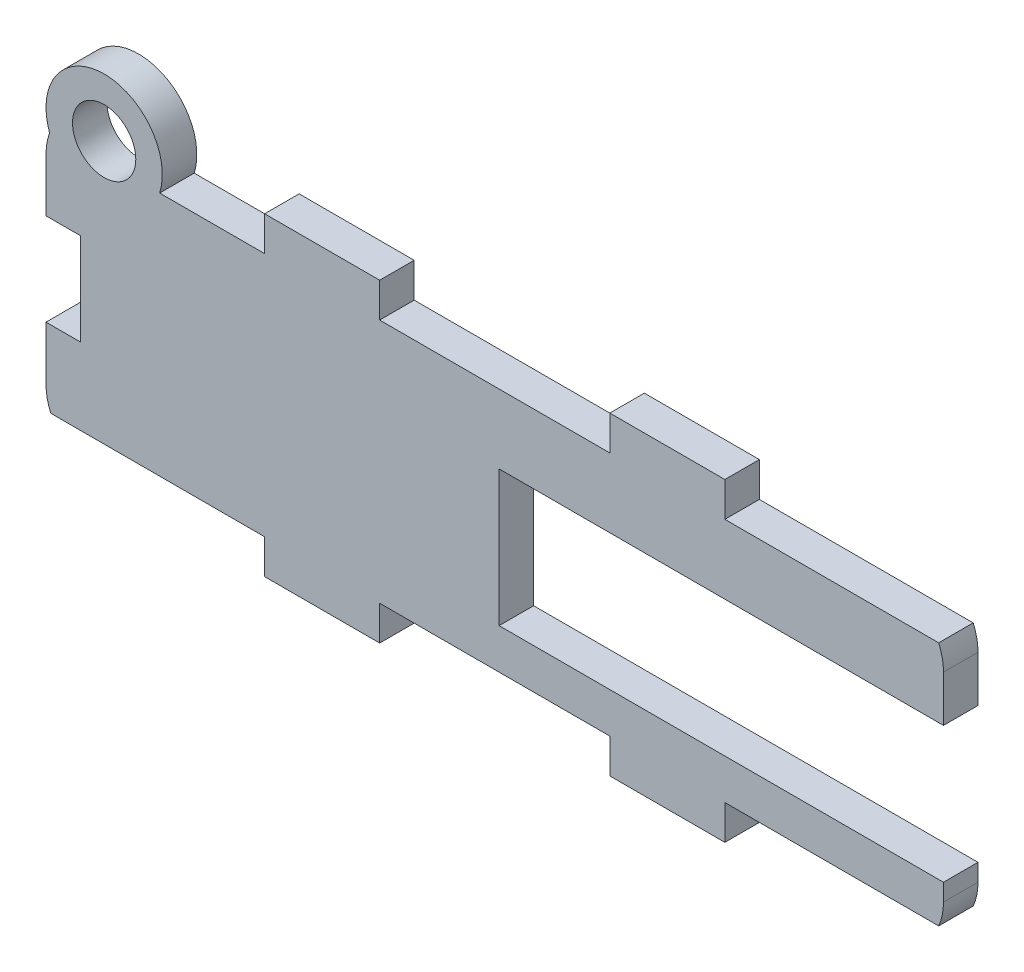
ISO-10303-21;
HEADER;
FILE_DESCRIPTION(('STEP AP214'),'2;1');
FILE_NAME('part.step','',(''),(''),'','','');
FILE_SCHEMA(('AUTOMOTIVE_DESIGN { 1 0 10303 214 1 1 1 1 }'));
ENDSEC;
DATA;
#1=APPLICATION_CONTEXT('core data for automotive mechanical design processes');
#2=APPLICATION_PROTOCOL_DEFINITION('international standard','automotive_design',2000,#1);
#3=PRODUCT_CONTEXT('',#1,'mechanical');
#4=PRODUCT('Part','Part','',(#3));
#5=PRODUCT_RELATED_PRODUCT_CATEGORY('part','',(#4));
#6=PRODUCT_DEFINITION_FORMATION('','',#4);
#7=PRODUCT_DEFINITION_CONTEXT('part definition',#1,'design');
#8=PRODUCT_DEFINITION('design','',#6,#7);
#9=PRODUCT_DEFINITION_SHAPE('','',#8);
#10=(LENGTH_UNIT() NAMED_UNIT(*) SI_UNIT(.MILLI.,.METRE.));
#11=(NAMED_UNIT(*) PLANE_ANGLE_UNIT() SI_UNIT($,.RADIAN.));
#12=(NAMED_UNIT(*) SI_UNIT($,.STERADIAN.) SOLID_ANGLE_UNIT());
#13=UNCERTAINTY_MEASURE_WITH_UNIT(LENGTH_MEASURE(1.E-05),#10,'distance_accuracy_value','');
#14=(GEOMETRIC_REPRESENTATION_CONTEXT(3) GLOBAL_UNCERTAINTY_ASSIGNED_CONTEXT((#13)) GLOBAL_UNIT_ASSIGNED_CONTEXT((#10,
#11,#12)) REPRESENTATION_CONTEXT('',''));
#15=CARTESIAN_POINT('',(0.,0.,0.));
#16=DIRECTION('',(0.,0.,1.));
#17=DIRECTION('',(1.,0.,0.));
#18=AXIS2_PLACEMENT_3D('',#15,#16,#17);
#19=CARTESIAN_POINT('',(-26.,2.00000000000004,3.));
#20=DIRECTION('',(1.,0.,0.));
#21=DIRECTION('',(0.,0.,-1.));
#22=AXIS2_PLACEMENT_3D('',#19,#20,#21);
#23=PLANE('',#22);
#24=DIRECTION('',(0.,0.,1.));
#25=VECTOR('',#24,1.);
#26=CARTESIAN_POINT('',(-26.,6.65592079454651,0.));
#27=LINE('',#26,#25);
#28=CARTESIAN_POINT('',(-26.,6.65592079454651,0.));
#29=VERTEX_POINT('',#28);
#30=CARTESIAN_POINT('',(-26.,6.65592079454651,3.));
#31=VERTEX_POINT('',#30);
#32=EDGE_CURVE('E252',#29,#31,#27,.T.);
#33=ORIENTED_EDGE('',*,*,#32,.F.);
#34=DIRECTION('',(0.,-1.,0.));
#35=VECTOR('',#34,1.);
#36=CARTESIAN_POINT('',(-26.,2.00000000000004,0.));
#37=LINE('',#36,#35);
#38=CARTESIAN_POINT('',(-26.,2.,0.));
#39=VERTEX_POINT('',#38);
#40=EDGE_CURVE('E264',#29,#39,#37,.T.);
#41=ORIENTED_EDGE('',*,*,#40,.T.);
#42=DIRECTION('',(0.,0.,-1.));
#43=VECTOR('',#42,1.);
#44=CARTESIAN_POINT('',(-26.,2.,3.));
#45=LINE('',#44,#43);
#46=CARTESIAN_POINT('',(-26.,2.,3.));
#47=VERTEX_POINT('',#46);
#48=EDGE_CURVE('E360',#47,#39,#45,.T.);
#49=ORIENTED_EDGE('',*,*,#48,.F.);
#50=DIRECTION('',(0.,-1.,0.));
#51=VECTOR('',#50,1.);
#52=CARTESIAN_POINT('',(-26.,2.00000000000004,3.));
#53=LINE('',#52,#51);
#54=EDGE_CURVE('E266',#31,#47,#53,.T.);
#55=ORIENTED_EDGE('',*,*,#54,.F.);
#56=EDGE_LOOP('',(#33,#41,#49,#55));
#57=FACE_BOUND('',#56,.T.);
#58=ADVANCED_FACE('F33',(#57),#23,.F.);
#59=CARTESIAN_POINT('',(47.,19.311841589093,3.));
#60=DIRECTION('',(0.,0.,-1.));
#61=DIRECTION('',(-1.,0.,0.));
#62=AXIS2_PLACEMENT_3D('',#59,#60,#61);
#63=PLANE('',#62);
#64=CARTESIAN_POINT('',(-20.9460971389768,22.811841589093,3.));
#65=DIRECTION('',(0.,0.,1.));
#66=DIRECTION('',(1.,0.,0.));
#67=AXIS2_PLACEMENT_3D('',#64,#65,#66);
#68=CIRCLE('',#67,2.74976983341872);
#69=CARTESIAN_POINT('',(-18.1963273055581,22.811841589093,3.));
#70=VERTEX_POINT('',#69);
#71=EDGE_CURVE('E267',#70,#70,#68,.T.);
#72=ORIENTED_EDGE('',*,*,#71,.F.);
#73=EDGE_LOOP('',(#72));
#74=FACE_BOUND('',#73,.T.);
#75=DIRECTION('',(-1.,0.,0.));
#76=VECTOR('',#75,1.);
#77=CARTESIAN_POINT('',(-23.0000000000001,6.65592079454651,3.));
#78=LINE('',#77,#76);
#79=CARTESIAN_POINT('',(-23.0000000000001,6.65592079454651,3.));
#80=VERTEX_POINT('',#79);
#81=EDGE_CURVE('E592',#80,#31,#78,.T.);
#82=ORIENTED_EDGE('',*,*,#81,.T.);
#83=ORIENTED_EDGE('',*,*,#54,.T.);
#84=CARTESIAN_POINT('',(-21.,2.,3.));
#85=DIRECTION('',(0.,0.,1.));
#86=DIRECTION('',(-1.,0.,0.));
#87=AXIS2_PLACEMENT_3D('',#84,#85,#86);
#88=CIRCLE('',#87,5.);
#89=CARTESIAN_POINT('',(-25.5825756949558,0.,3.));
#90=VERTEX_POINT('',#89);
#91=EDGE_CURVE('E468',#47,#90,#88,.T.);
#92=ORIENTED_EDGE('',*,*,#91,.T.);
#93=DIRECTION('',(1.,0.,0.));
#94=VECTOR('',#93,1.);
#95=CARTESIAN_POINT('',(-6.99999999999999,0.,3.));
#96=LINE('',#95,#94);
#97=CARTESIAN_POINT('',(-6.99999999999999,0.,3.));
#98=VERTEX_POINT('',#97);
#99=EDGE_CURVE('E470',#90,#98,#96,.T.);
#100=ORIENTED_EDGE('',*,*,#99,.T.);
#101=DIRECTION('',(0.,-1.,0.));
#102=VECTOR('',#101,1.);
#103=CARTESIAN_POINT('',(-6.99999999999999,0.,3.));
#104=LINE('',#103,#102);
#105=CARTESIAN_POINT('',(-6.99999999999999,-3.,3.));
#106=VERTEX_POINT('',#105);
#107=EDGE_CURVE('E472',#98,#106,#104,.T.);
#108=ORIENTED_EDGE('',*,*,#107,.T.);
#109=DIRECTION('',(1.,0.,0.));
#110=VECTOR('',#109,1.);
#111=CARTESIAN_POINT('',(-6.99999999999999,-3.,3.));
#112=LINE('',#111,#110);
#113=CARTESIAN_POINT('',(3.00000000000001,-3.,3.));
#114=VERTEX_POINT('',#113);
#115=EDGE_CURVE('E474',#106,#114,#112,.T.);
#116=ORIENTED_EDGE('',*,*,#115,.T.);
#117=DIRECTION('',(0.,1.,0.));
#118=VECTOR('',#117,1.);
#119=CARTESIAN_POINT('',(3.00000000000001,-3.,3.));
#120=LINE('',#119,#118);
#121=CARTESIAN_POINT('',(3.00000000000001,0.,3.));
#122=VERTEX_POINT('',#121);
#123=EDGE_CURVE('E476',#114,#122,#120,.T.);
#124=ORIENTED_EDGE('',*,*,#123,.T.);
#125=DIRECTION('',(1.,0.,0.));
#126=VECTOR('',#125,1.);
#127=CARTESIAN_POINT('',(3.00000000000001,0.,3.));
#128=LINE('',#127,#126);
#129=CARTESIAN_POINT('',(23.,0.,3.));
#130=VERTEX_POINT('',#129);
#131=EDGE_CURVE('E478',#122,#130,#128,.T.);
#132=ORIENTED_EDGE('',*,*,#131,.T.);
#133=DIRECTION('',(0.,-1.,0.));
#134=VECTOR('',#133,1.);
#135=CARTESIAN_POINT('',(23.,-3.,3.));
#136=LINE('',#135,#134);
#137=CARTESIAN_POINT('',(23.,-3.,3.));
#138=VERTEX_POINT('',#137);
#139=EDGE_CURVE('E480',#130,#138,#136,.T.);
#140=ORIENTED_EDGE('',*,*,#139,.T.);
#141=DIRECTION('',(1.,0.,0.));
#142=VECTOR('',#141,1.);
#143=CARTESIAN_POINT('',(23.,-3.,3.));
#144=LINE('',#143,#142);
#145=CARTESIAN_POINT('',(33.,-3.,3.));
#146=VERTEX_POINT('',#145);
#147=EDGE_CURVE('E482',#138,#146,#144,.T.);
#148=ORIENTED_EDGE('',*,*,#147,.T.);
#149=DIRECTION('',(0.,1.,0.));
#150=VECTOR('',#149,1.);
#151=CARTESIAN_POINT('',(33.,-3.,3.));
#152=LINE('',#151,#150);
#153=CARTESIAN_POINT('',(33.,0.,3.));
#154=VERTEX_POINT('',#153);
#155=EDGE_CURVE('E484',#146,#154,#152,.T.);
#156=ORIENTED_EDGE('',*,*,#155,.T.);
#157=DIRECTION('',(1.,0.,0.));
#158=VECTOR('',#157,1.);
#159=CARTESIAN_POINT('',(33.,0.,3.));
#160=LINE('',#159,#158);
#161=CARTESIAN_POINT('',(51.5825756949558,0.,3.));
#162=VERTEX_POINT('',#161);
#163=EDGE_CURVE('E486',#154,#162,#160,.T.);
#164=ORIENTED_EDGE('',*,*,#163,.T.);
#165=CARTESIAN_POINT('',(47.,2.,3.));
#166=DIRECTION('',(0.,0.,1.));
#167=DIRECTION('',(1.,0.,0.));
#168=AXIS2_PLACEMENT_3D('',#165,#166,#167);
#169=CIRCLE('',#168,5.);
#170=CARTESIAN_POINT('',(52.,2.00000000000004,3.));
#171=VERTEX_POINT('',#170);
#172=EDGE_CURVE('E488',#162,#171,#169,.T.);
#173=ORIENTED_EDGE('',*,*,#172,.T.);
#174=DIRECTION('',(0.,1.,0.));
#175=VECTOR('',#174,1.);
#176=CARTESIAN_POINT('',(52.,2.00000000000004,3.));
#177=LINE('',#176,#175);
#178=CARTESIAN_POINT('',(52.,3.5,3.));
#179=VERTEX_POINT('',#178);
#180=EDGE_CURVE('E491',#171,#179,#177,.T.);
#181=ORIENTED_EDGE('',*,*,#180,.T.);
#182=DIRECTION('',(1.,0.,0.));
#183=VECTOR('',#182,1.);
#184=CARTESIAN_POINT('',(13.38,3.49999999999997,3.));
#185=LINE('',#184,#183);
#186=CARTESIAN_POINT('',(13.38,3.49999999999997,3.));
#187=VERTEX_POINT('',#186);
#188=EDGE_CURVE('E433',#187,#179,#185,.T.);
#189=ORIENTED_EDGE('',*,*,#188,.F.);
#190=DIRECTION('',(0.,-1.,0.));
#191=VECTOR('',#190,1.);
#192=CARTESIAN_POINT('',(13.38,3.49999999999997,3.));
#193=LINE('',#192,#191);
#194=CARTESIAN_POINT('',(13.38,15.3,3.));
#195=VERTEX_POINT('',#194);
#196=EDGE_CURVE('E438',#195,#187,#193,.T.);
#197=ORIENTED_EDGE('',*,*,#196,.F.);
#198=DIRECTION('',(-1.,0.,0.));
#199=VECTOR('',#198,1.);
#200=CARTESIAN_POINT('',(13.38,15.3,3.));
#201=LINE('',#200,#199);
#202=CARTESIAN_POINT('',(52.,15.3,3.));
#203=VERTEX_POINT('',#202);
#204=EDGE_CURVE('E435',#203,#195,#201,.T.);
#205=ORIENTED_EDGE('',*,*,#204,.F.);
#206=CARTESIAN_POINT('',(52.,19.311841589093,3.));
#207=VERTEX_POINT('',#206);
#208=EDGE_CURVE('E490',#203,#207,#177,.T.);
#209=ORIENTED_EDGE('',*,*,#208,.T.);
#210=CARTESIAN_POINT('',(47.,19.311841589093,3.));
#211=DIRECTION('',(0.,0.,1.));
#212=DIRECTION('',(-1.,0.,0.));
#213=AXIS2_PLACEMENT_3D('',#210,#211,#212);
#214=CIRCLE('',#213,5.);
#215=CARTESIAN_POINT('',(51.5825756949558,21.311841589093,3.));
#216=VERTEX_POINT('',#215);
#217=EDGE_CURVE('E494',#207,#216,#214,.T.);
#218=ORIENTED_EDGE('',*,*,#217,.T.);
#219=DIRECTION('',(-1.,0.,0.));
#220=VECTOR('',#219,1.);
#221=CARTESIAN_POINT('',(33.,21.311841589093,3.));
#222=LINE('',#221,#220);
#223=CARTESIAN_POINT('',(33.,21.311841589093,3.));
#224=VERTEX_POINT('',#223);
#225=EDGE_CURVE('E496',#216,#224,#222,.T.);
#226=ORIENTED_EDGE('',*,*,#225,.T.);
#227=DIRECTION('',(0.,1.,0.));
#228=VECTOR('',#227,1.);
#229=CARTESIAN_POINT('',(33.,24.311841589093,3.));
#230=LINE('',#229,#228);
#231=CARTESIAN_POINT('',(33.,24.311841589093,3.));
#232=VERTEX_POINT('',#231);
#233=EDGE_CURVE('E318',#224,#232,#230,.T.);
#234=ORIENTED_EDGE('',*,*,#233,.T.);
#235=DIRECTION('',(-1.,0.,0.));
#236=VECTOR('',#235,1.);
#237=CARTESIAN_POINT('',(23.,24.311841589093,3.));
#238=LINE('',#237,#236);
#239=CARTESIAN_POINT('',(23.,24.311841589093,3.));
#240=VERTEX_POINT('',#239);
#241=EDGE_CURVE('E313',#232,#240,#238,.T.);
#242=ORIENTED_EDGE('',*,*,#241,.T.);
#243=DIRECTION('',(0.,-1.,0.));
#244=VECTOR('',#243,1.);
#245=CARTESIAN_POINT('',(23.,24.311841589093,3.));
#246=LINE('',#245,#244);
#247=CARTESIAN_POINT('',(23.,21.311841589093,3.));
#248=VERTEX_POINT('',#247);
#249=EDGE_CURVE('E452',#240,#248,#246,.T.);
#250=ORIENTED_EDGE('',*,*,#249,.T.);
#251=DIRECTION('',(-1.,0.,0.));
#252=VECTOR('',#251,1.);
#253=CARTESIAN_POINT('',(3.00000000000001,21.311841589093,3.));
#254=LINE('',#253,#252);
#255=CARTESIAN_POINT('',(3.00000000000001,21.311841589093,3.));
#256=VERTEX_POINT('',#255);
#257=EDGE_CURVE('E384',#248,#256,#254,.T.);
#258=ORIENTED_EDGE('',*,*,#257,.T.);
#259=DIRECTION('',(0.,1.,0.));
#260=VECTOR('',#259,1.);
#261=CARTESIAN_POINT('',(3.00000000000001,24.311841589093,3.));
#262=LINE('',#261,#260);
#263=CARTESIAN_POINT('',(3.00000000000001,24.311841589093,3.));
#264=VERTEX_POINT('',#263);
#265=EDGE_CURVE('E455',#256,#264,#262,.T.);
#266=ORIENTED_EDGE('',*,*,#265,.T.);
#267=DIRECTION('',(-1.,0.,0.));
#268=VECTOR('',#267,1.);
#269=CARTESIAN_POINT('',(-6.99999999999999,24.311841589093,3.));
#270=LINE('',#269,#268);
#271=CARTESIAN_POINT('',(-6.99999999999999,24.311841589093,3.));
#272=VERTEX_POINT('',#271);
#273=EDGE_CURVE('E457',#264,#272,#270,.T.);
#274=ORIENTED_EDGE('',*,*,#273,.T.);
#275=DIRECTION('',(0.,-1.,0.));
#276=VECTOR('',#275,1.);
#277=CARTESIAN_POINT('',(-6.99999999999999,21.311841589093,3.));
#278=LINE('',#277,#276);
#279=CARTESIAN_POINT('',(-6.99999999999999,21.311841589093,3.));
#280=VERTEX_POINT('',#279);
#281=EDGE_CURVE('E459',#272,#280,#278,.T.);
#282=ORIENTED_EDGE('',*,*,#281,.T.);
#283=DIRECTION('',(-1.,0.,0.));
#284=VECTOR('',#283,1.);
#285=CARTESIAN_POINT('',(-6.99999999999999,21.311841589093,3.));
#286=LINE('',#285,#284);
#287=CARTESIAN_POINT('',(-16.1199253508347,21.311841589093,3.));
#288=VERTEX_POINT('',#287);
#289=EDGE_CURVE('E461',#280,#288,#286,.T.);
#290=ORIENTED_EDGE('',*,*,#289,.T.);
#291=CARTESIAN_POINT('',(-20.9460971389768,22.811841589093,3.));
#292=DIRECTION('',(0.,0.,1.));
#293=DIRECTION('',(1.,0.,0.));
#294=AXIS2_PLACEMENT_3D('',#291,#292,#293);
#295=CIRCLE('',#294,5.05390286102321);
#296=CARTESIAN_POINT('',(-25.6855550398169,21.0569988796678,3.));
#297=VERTEX_POINT('',#296);
#298=EDGE_CURVE('E56',#288,#297,#295,.T.);
#299=ORIENTED_EDGE('',*,*,#298,.T.);
#300=CARTESIAN_POINT('',(-21.,19.311841589093,3.));
#301=DIRECTION('',(0.,0.,1.));
#302=DIRECTION('',(-1.,0.,0.));
#303=AXIS2_PLACEMENT_3D('',#300,#301,#302);
#304=CIRCLE('',#303,5.);
#305=CARTESIAN_POINT('',(-26.,19.311841589093,3.));
#306=VERTEX_POINT('',#305);
#307=EDGE_CURVE('E463',#297,#306,#304,.T.);
#308=ORIENTED_EDGE('',*,*,#307,.T.);
#309=CARTESIAN_POINT('',(-26.,14.6559207945465,3.));
#310=VERTEX_POINT('',#309);
#311=EDGE_CURVE('E465',#306,#310,#53,.T.);
#312=ORIENTED_EDGE('',*,*,#311,.T.);
#313=DIRECTION('',(-1.,0.,0.));
#314=VECTOR('',#313,1.);
#315=CARTESIAN_POINT('',(-23.0000000000001,14.6559207945465,3.));
#316=LINE('',#315,#314);
#317=CARTESIAN_POINT('',(-23.0000000000001,14.6559207945465,3.));
#318=VERTEX_POINT('',#317);
#319=EDGE_CURVE('E595',#318,#310,#316,.T.);
#320=ORIENTED_EDGE('',*,*,#319,.F.);
#321=DIRECTION('',(0.,1.,0.));
#322=VECTOR('',#321,1.);
#323=CARTESIAN_POINT('',(-23.0000000000001,6.65592079454651,3.));
#324=LINE('',#323,#322);
#325=EDGE_CURVE('E259',#80,#318,#324,.T.);
#326=ORIENTED_EDGE('',*,*,#325,.F.);
#327=EDGE_LOOP('',(#82,#83,#92,#100,#108,#116,#124,#132,#140,#148,#156,#164,#173,#181,#189,#197,
#205,#209,#218,#226,#234,#242,#250,#258,#266,#274,#282,#290,#299,#308,#312,#320,#326));
#328=FACE_BOUND('',#327,.T.);
#329=ADVANCED_FACE('F527',(#74,#328),#63,.F.);
#330=CARTESIAN_POINT('',(47.,19.311841589093,0.));
#331=DIRECTION('',(0.,0.,-1.));
#332=DIRECTION('',(-1.,0.,0.));
#333=AXIS2_PLACEMENT_3D('',#330,#331,#332);
#334=PLANE('',#333);
#335=CARTESIAN_POINT('',(-20.9460971389768,22.811841589093,0.));
#336=DIRECTION('',(0.,0.,1.));
#337=DIRECTION('',(1.,0.,0.));
#338=AXIS2_PLACEMENT_3D('',#335,#336,#337);
#339=CIRCLE('',#338,2.74976983341872);
#340=CARTESIAN_POINT('',(-18.1963273055581,22.811841589093,0.));
#341=VERTEX_POINT('',#340);
#342=EDGE_CURVE('E420',#341,#341,#339,.T.);
#343=ORIENTED_EDGE('',*,*,#342,.T.);
#344=EDGE_LOOP('',(#343));
#345=FACE_BOUND('',#344,.T.);
#346=ORIENTED_EDGE('',*,*,#40,.F.);
#347=DIRECTION('',(-1.,0.,0.));
#348=VECTOR('',#347,1.);
#349=CARTESIAN_POINT('',(-23.0000000000001,6.65592079454651,0.));
#350=LINE('',#349,#348);
#351=CARTESIAN_POINT('',(-23.0000000000001,6.65592079454651,0.));
#352=VERTEX_POINT('',#351);
#353=EDGE_CURVE('E248',#352,#29,#350,.T.);
#354=ORIENTED_EDGE('',*,*,#353,.F.);
#355=DIRECTION('',(0.,1.,0.));
#356=VECTOR('',#355,1.);
#357=CARTESIAN_POINT('',(-23.0000000000001,6.65592079454651,0.));
#358=LINE('',#357,#356);
#359=CARTESIAN_POINT('',(-23.0000000000001,14.6559207945465,0.));
#360=VERTEX_POINT('',#359);
#361=EDGE_CURVE('E599',#352,#360,#358,.T.);
#362=ORIENTED_EDGE('',*,*,#361,.T.);
#363=DIRECTION('',(-1.,0.,0.));
#364=VECTOR('',#363,1.);
#365=CARTESIAN_POINT('',(-23.0000000000001,14.6559207945465,0.));
#366=LINE('',#365,#364);
#367=CARTESIAN_POINT('',(-26.,14.6559207945465,0.));
#368=VERTEX_POINT('',#367);
#369=EDGE_CURVE('E48',#360,#368,#366,.T.);
#370=ORIENTED_EDGE('',*,*,#369,.T.);
#371=CARTESIAN_POINT('',(-26.,19.311841589093,0.));
#372=VERTEX_POINT('',#371);
#373=EDGE_CURVE('E274',#372,#368,#37,.T.);
#374=ORIENTED_EDGE('',*,*,#373,.F.);
#375=CARTESIAN_POINT('',(-21.,19.311841589093,0.));
#376=DIRECTION('',(0.,0.,1.));
#377=DIRECTION('',(-1.,0.,0.));
#378=AXIS2_PLACEMENT_3D('',#375,#376,#377);
#379=CIRCLE('',#378,5.);
#380=CARTESIAN_POINT('',(-25.6855550398169,21.0569988796678,0.));
#381=VERTEX_POINT('',#380);
#382=EDGE_CURVE('E275',#381,#372,#379,.T.);
#383=ORIENTED_EDGE('',*,*,#382,.F.);
#384=CARTESIAN_POINT('',(-20.9460971389768,22.811841589093,0.));
#385=DIRECTION('',(0.,0.,1.));
#386=DIRECTION('',(1.,0.,0.));
#387=AXIS2_PLACEMENT_3D('',#384,#385,#386);
#388=CIRCLE('',#387,5.05390286102321);
#389=CARTESIAN_POINT('',(-16.1199253508347,21.311841589093,0.));
#390=VERTEX_POINT('',#389);
#391=EDGE_CURVE('E411',#390,#381,#388,.T.);
#392=ORIENTED_EDGE('',*,*,#391,.F.);
#393=DIRECTION('',(-1.,0.,0.));
#394=VECTOR('',#393,1.);
#395=CARTESIAN_POINT('',(-6.99999999999999,21.311841589093,0.));
#396=LINE('',#395,#394);
#397=CARTESIAN_POINT('',(-6.99999999999999,21.311841589093,0.));
#398=VERTEX_POINT('',#397);
#399=EDGE_CURVE('E278',#398,#390,#396,.T.);
#400=ORIENTED_EDGE('',*,*,#399,.F.);
#401=DIRECTION('',(0.,-1.,0.));
#402=VECTOR('',#401,1.);
#403=CARTESIAN_POINT('',(-6.99999999999999,21.311841589093,0.));
#404=LINE('',#403,#402);
#405=CARTESIAN_POINT('',(-6.99999999999999,24.311841589093,0.));
#406=VERTEX_POINT('',#405);
#407=EDGE_CURVE('E399',#406,#398,#404,.T.);
#408=ORIENTED_EDGE('',*,*,#407,.F.);
#409=DIRECTION('',(-1.,0.,0.));
#410=VECTOR('',#409,1.);
#411=CARTESIAN_POINT('',(-6.99999999999999,24.311841589093,0.));
#412=LINE('',#411,#410);
#413=CARTESIAN_POINT('',(3.00000000000001,24.311841589093,0.));
#414=VERTEX_POINT('',#413);
#415=EDGE_CURVE('E392',#414,#406,#412,.T.);
#416=ORIENTED_EDGE('',*,*,#415,.F.);
#417=DIRECTION('',(0.,1.,0.));
#418=VECTOR('',#417,1.);
#419=CARTESIAN_POINT('',(3.00000000000001,24.311841589093,0.));
#420=LINE('',#419,#418);
#421=CARTESIAN_POINT('',(3.00000000000001,21.311841589093,0.));
#422=VERTEX_POINT('',#421);
#423=EDGE_CURVE('E390',#422,#414,#420,.T.);
#424=ORIENTED_EDGE('',*,*,#423,.F.);
#425=DIRECTION('',(-1.,0.,0.));
#426=VECTOR('',#425,1.);
#427=CARTESIAN_POINT('',(3.00000000000001,21.311841589093,0.));
#428=LINE('',#427,#426);
#429=CARTESIAN_POINT('',(23.,21.311841589093,0.));
#430=VERTEX_POINT('',#429);
#431=EDGE_CURVE('E383',#430,#422,#428,.T.);
#432=ORIENTED_EDGE('',*,*,#431,.F.);
#433=DIRECTION('',(0.,-1.,0.));
#434=VECTOR('',#433,1.);
#435=CARTESIAN_POINT('',(23.,24.311841589093,0.));
#436=LINE('',#435,#434);
#437=CARTESIAN_POINT('',(23.,24.311841589093,0.));
#438=VERTEX_POINT('',#437);
#439=EDGE_CURVE('E388',#438,#430,#436,.T.);
#440=ORIENTED_EDGE('',*,*,#439,.F.);
#441=DIRECTION('',(-1.,0.,0.));
#442=VECTOR('',#441,1.);
#443=CARTESIAN_POINT('',(23.,24.311841589093,0.));
#444=LINE('',#443,#442);
#445=CARTESIAN_POINT('',(33.,24.311841589093,0.));
#446=VERTEX_POINT('',#445);
#447=EDGE_CURVE('E394',#446,#438,#444,.T.);
#448=ORIENTED_EDGE('',*,*,#447,.F.);
#449=DIRECTION('',(0.,1.,0.));
#450=VECTOR('',#449,1.);
#451=CARTESIAN_POINT('',(33.,24.311841589093,0.));
#452=LINE('',#451,#450);
#453=CARTESIAN_POINT('',(33.,21.311841589093,0.));
#454=VERTEX_POINT('',#453);
#455=EDGE_CURVE('E311',#454,#446,#452,.T.);
#456=ORIENTED_EDGE('',*,*,#455,.F.);
#457=DIRECTION('',(-1.,0.,0.));
#458=VECTOR('',#457,1.);
#459=CARTESIAN_POINT('',(33.,21.311841589093,0.));
#460=LINE('',#459,#458);
#461=CARTESIAN_POINT('',(51.5825756949558,21.311841589093,0.));
#462=VERTEX_POINT('',#461);
#463=EDGE_CURVE('E309',#462,#454,#460,.T.);
#464=ORIENTED_EDGE('',*,*,#463,.F.);
#465=CARTESIAN_POINT('',(47.,19.311841589093,0.));
#466=DIRECTION('',(0.,0.,1.));
#467=DIRECTION('',(-1.,0.,0.));
#468=AXIS2_PLACEMENT_3D('',#465,#466,#467);
#469=CIRCLE('',#468,5.);
#470=CARTESIAN_POINT('',(52.,19.311841589093,0.));
#471=VERTEX_POINT('',#470);
#472=EDGE_CURVE('E307',#471,#462,#469,.T.);
#473=ORIENTED_EDGE('',*,*,#472,.F.);
#474=DIRECTION('',(0.,1.,0.));
#475=VECTOR('',#474,1.);
#476=CARTESIAN_POINT('',(52.,2.00000000000004,0.));
#477=LINE('',#476,#475);
#478=CARTESIAN_POINT('',(52.,15.3,0.));
#479=VERTEX_POINT('',#478);
#480=EDGE_CURVE('E303',#479,#471,#477,.T.);
#481=ORIENTED_EDGE('',*,*,#480,.F.);
#482=DIRECTION('',(-1.,0.,0.));
#483=VECTOR('',#482,1.);
#484=CARTESIAN_POINT('',(13.38,15.3,0.));
#485=LINE('',#484,#483);
#486=CARTESIAN_POINT('',(13.38,15.3,0.));
#487=VERTEX_POINT('',#486);
#488=EDGE_CURVE('E413',#479,#487,#485,.T.);
#489=ORIENTED_EDGE('',*,*,#488,.T.);
#490=DIRECTION('',(0.,-1.,0.));
#491=VECTOR('',#490,1.);
#492=CARTESIAN_POINT('',(13.38,3.49999999999997,0.));
#493=LINE('',#492,#491);
#494=CARTESIAN_POINT('',(13.38,3.49999999999997,0.));
#495=VERTEX_POINT('',#494);
#496=EDGE_CURVE('E427',#487,#495,#493,.T.);
#497=ORIENTED_EDGE('',*,*,#496,.T.);
#498=DIRECTION('',(1.,0.,0.));
#499=VECTOR('',#498,1.);
#500=CARTESIAN_POINT('',(13.38,3.49999999999997,0.));
#501=LINE('',#500,#499);
#502=CARTESIAN_POINT('',(52.,3.5,0.));
#503=VERTEX_POINT('',#502);
#504=EDGE_CURVE('E430',#495,#503,#501,.T.);
#505=ORIENTED_EDGE('',*,*,#504,.T.);
#506=CARTESIAN_POINT('',(52.,2.00000000000004,0.));
#507=VERTEX_POINT('',#506);
#508=EDGE_CURVE('E304',#507,#503,#477,.T.);
#509=ORIENTED_EDGE('',*,*,#508,.F.);
#510=CARTESIAN_POINT('',(47.,2.,0.));
#511=DIRECTION('',(0.,0.,1.));
#512=DIRECTION('',(1.,0.,0.));
#513=AXIS2_PLACEMENT_3D('',#510,#511,#512);
#514=CIRCLE('',#513,5.);
#515=CARTESIAN_POINT('',(51.5825756949558,0.,0.));
#516=VERTEX_POINT('',#515);
#517=EDGE_CURVE('E301',#516,#507,#514,.T.);
#518=ORIENTED_EDGE('',*,*,#517,.F.);
#519=DIRECTION('',(1.,0.,0.));
#520=VECTOR('',#519,1.);
#521=CARTESIAN_POINT('',(33.,0.,0.));
#522=LINE('',#521,#520);
#523=CARTESIAN_POINT('',(33.,0.,0.));
#524=VERTEX_POINT('',#523);
#525=EDGE_CURVE('E299',#524,#516,#522,.T.);
#526=ORIENTED_EDGE('',*,*,#525,.F.);
#527=DIRECTION('',(0.,1.,0.));
#528=VECTOR('',#527,1.);
#529=CARTESIAN_POINT('',(33.,-3.,0.));
#530=LINE('',#529,#528);
#531=CARTESIAN_POINT('',(33.,-3.,0.));
#532=VERTEX_POINT('',#531);
#533=EDGE_CURVE('E297',#532,#524,#530,.T.);
#534=ORIENTED_EDGE('',*,*,#533,.F.);
#535=DIRECTION('',(1.,0.,0.));
#536=VECTOR('',#535,1.);
#537=CARTESIAN_POINT('',(23.,-3.,0.));
#538=LINE('',#537,#536);
#539=CARTESIAN_POINT('',(23.,-3.,0.));
#540=VERTEX_POINT('',#539);
#541=EDGE_CURVE('E295',#540,#532,#538,.T.);
#542=ORIENTED_EDGE('',*,*,#541,.F.);
#543=DIRECTION('',(0.,-1.,0.));
#544=VECTOR('',#543,1.);
#545=CARTESIAN_POINT('',(23.,-3.,0.));
#546=LINE('',#545,#544);
#547=CARTESIAN_POINT('',(23.,0.,0.));
#548=VERTEX_POINT('',#547);
#549=EDGE_CURVE('E293',#548,#540,#546,.T.);
#550=ORIENTED_EDGE('',*,*,#549,.F.);
#551=DIRECTION('',(1.,0.,0.));
#552=VECTOR('',#551,1.);
#553=CARTESIAN_POINT('',(3.00000000000001,0.,0.));
#554=LINE('',#553,#552);
#555=CARTESIAN_POINT('',(3.00000000000001,0.,0.));
#556=VERTEX_POINT('',#555);
#557=EDGE_CURVE('E291',#556,#548,#554,.T.);
#558=ORIENTED_EDGE('',*,*,#557,.F.);
#559=DIRECTION('',(0.,1.,0.));
#560=VECTOR('',#559,1.);
#561=CARTESIAN_POINT('',(3.00000000000001,-3.,0.));
#562=LINE('',#561,#560);
#563=CARTESIAN_POINT('',(3.00000000000001,-3.,0.));
#564=VERTEX_POINT('',#563);
#565=EDGE_CURVE('E289',#564,#556,#562,.T.);
#566=ORIENTED_EDGE('',*,*,#565,.F.);
#567=DIRECTION('',(1.,0.,0.));
#568=VECTOR('',#567,1.);
#569=CARTESIAN_POINT('',(-6.99999999999999,-3.,0.));
#570=LINE('',#569,#568);
#571=CARTESIAN_POINT('',(-6.99999999999999,-3.,0.));
#572=VERTEX_POINT('',#571);
#573=EDGE_CURVE('E287',#572,#564,#570,.T.);
#574=ORIENTED_EDGE('',*,*,#573,.F.);
#575=DIRECTION('',(0.,-1.,0.));
#576=VECTOR('',#575,1.);
#577=CARTESIAN_POINT('',(-6.99999999999999,0.,0.));
#578=LINE('',#577,#576);
#579=CARTESIAN_POINT('',(-6.99999999999999,0.,0.));
#580=VERTEX_POINT('',#579);
#581=EDGE_CURVE('E285',#580,#572,#578,.T.);
#582=ORIENTED_EDGE('',*,*,#581,.F.);
#583=DIRECTION('',(1.,0.,0.));
#584=VECTOR('',#583,1.);
#585=CARTESIAN_POINT('',(-6.99999999999999,0.,0.));
#586=LINE('',#585,#584);
#587=CARTESIAN_POINT('',(-25.5825756949558,0.,0.));
#588=VERTEX_POINT('',#587);
#589=EDGE_CURVE('E283',#588,#580,#586,.T.);
#590=ORIENTED_EDGE('',*,*,#589,.F.);
#591=CARTESIAN_POINT('',(-21.,2.,0.));
#592=DIRECTION('',(0.,0.,1.));
#593=DIRECTION('',(-1.,0.,0.));
#594=AXIS2_PLACEMENT_3D('',#591,#592,#593);
#595=CIRCLE('',#594,5.);
#596=EDGE_CURVE('E273',#39,#588,#595,.T.);
#597=ORIENTED_EDGE('',*,*,#596,.F.);
#598=EDGE_LOOP('',(#346,#354,#362,#370,#374,#383,#392,#400,#408,#416,#424,#432,#440,#448,#456,
#464,#473,#481,#489,#497,#505,#509,#518,#526,#534,#542,#550,#558,#566,#574,#582,#590,#597));
#599=FACE_BOUND('',#598,.T.);
#600=ADVANCED_FACE('F271',(#345,#599),#334,.T.);
#601=CARTESIAN_POINT('',(-6.99999999999999,21.311841589093,3.));
#602=DIRECTION('',(0.,-1.,0.));
#603=DIRECTION('',(0.,0.,-1.));
#604=AXIS2_PLACEMENT_3D('',#601,#602,#603);
#605=PLANE('',#604);
#606=ORIENTED_EDGE('',*,*,#399,.T.);
#607=DIRECTION('',(0.,0.,1.));
#608=VECTOR('',#607,1.);
#609=CARTESIAN_POINT('',(-16.1199253508347,21.311841589093,0.));
#610=LINE('',#609,#608);
#611=EDGE_CURVE('E405',#390,#288,#610,.T.);
#612=ORIENTED_EDGE('',*,*,#611,.T.);
#613=ORIENTED_EDGE('',*,*,#289,.F.);
#614=DIRECTION('',(0.,0.,-1.));
#615=VECTOR('',#614,1.);
#616=CARTESIAN_POINT('',(-6.99999999999999,21.311841589093,3.));
#617=LINE('',#616,#615);
#618=EDGE_CURVE('E365',#280,#398,#617,.T.);
#619=ORIENTED_EDGE('',*,*,#618,.T.);
#620=EDGE_LOOP('',(#606,#612,#613,#619));
#621=FACE_BOUND('',#620,.T.);
#622=ADVANCED_FACE('F403',(#621),#605,.F.);
#623=CARTESIAN_POINT('',(52.,2.00000000000004,3.));
#624=DIRECTION('',(-1.,0.,0.));
#625=DIRECTION('',(0.,0.,1.));
#626=AXIS2_PLACEMENT_3D('',#623,#624,#625);
#627=PLANE('',#626);
#628=ORIENTED_EDGE('',*,*,#508,.T.);
#629=DIRECTION('',(0.,0.,1.));
#630=VECTOR('',#629,1.);
#631=CARTESIAN_POINT('',(52.,3.5,-0.00100000000000013));
#632=LINE('',#631,#630);
#633=EDGE_CURVE('E441',#503,#179,#632,.T.);
#634=ORIENTED_EDGE('',*,*,#633,.T.);
#635=ORIENTED_EDGE('',*,*,#180,.F.);
#636=DIRECTION('',(0.,0.,-1.));
#637=VECTOR('',#636,1.);
#638=CARTESIAN_POINT('',(52.,2.00000000000004,3.));
#639=LINE('',#638,#637);
#640=EDGE_CURVE('E327',#171,#507,#639,.T.);
#641=ORIENTED_EDGE('',*,*,#640,.T.);
#642=EDGE_LOOP('',(#628,#634,#635,#641));
#643=FACE_BOUND('',#642,.T.);
#644=ADVANCED_FACE('F537',(#643),#627,.F.);
#645=CARTESIAN_POINT('',(23.,24.311841589093,3.));
#646=DIRECTION('',(0.,-1.,0.));
#647=DIRECTION('',(0.,0.,-1.));
#648=AXIS2_PLACEMENT_3D('',#645,#646,#647);
#649=PLANE('',#648);
#650=ORIENTED_EDGE('',*,*,#447,.T.);
#651=DIRECTION('',(0.,0.,-1.));
#652=VECTOR('',#651,1.);
#653=CARTESIAN_POINT('',(23.,24.311841589093,3.));
#654=LINE('',#653,#652);
#655=EDGE_CURVE('E11',#240,#438,#654,.T.);
#656=ORIENTED_EDGE('',*,*,#655,.F.);
#657=ORIENTED_EDGE('',*,*,#241,.F.);
#658=DIRECTION('',(0.,0.,-1.));
#659=VECTOR('',#658,1.);
#660=CARTESIAN_POINT('',(33.,24.311841589093,3.));
#661=LINE('',#660,#659);
#662=EDGE_CURVE('E314',#232,#446,#661,.T.);
#663=ORIENTED_EDGE('',*,*,#662,.T.);
#664=EDGE_LOOP('',(#650,#656,#657,#663));
#665=FACE_BOUND('',#664,.T.);
#666=ADVANCED_FACE('F35',(#665),#649,.F.);
#667=CARTESIAN_POINT('',(23.,24.311841589093,3.));
#668=DIRECTION('',(1.,0.,0.));
#669=DIRECTION('',(0.,0.,-1.));
#670=AXIS2_PLACEMENT_3D('',#667,#668,#669);
#671=PLANE('',#670);
#672=ORIENTED_EDGE('',*,*,#439,.T.);
#673=DIRECTION('',(0.,0.,-1.));
#674=VECTOR('',#673,1.);
#675=CARTESIAN_POINT('',(23.,21.311841589093,3.));
#676=LINE('',#675,#674);
#677=EDGE_CURVE('E41',#248,#430,#676,.T.);
#678=ORIENTED_EDGE('',*,*,#677,.F.);
#679=ORIENTED_EDGE('',*,*,#249,.F.);
#680=ORIENTED_EDGE('',*,*,#655,.T.);
#681=EDGE_LOOP('',(#672,#678,#679,#680));
#682=FACE_BOUND('',#681,.T.);
#683=ADVANCED_FACE('F679',(#682),#671,.F.);
#684=CARTESIAN_POINT('',(3.00000000000001,21.311841589093,3.));
#685=DIRECTION('',(0.,-1.,0.));
#686=DIRECTION('',(0.,0.,-1.));
#687=AXIS2_PLACEMENT_3D('',#684,#685,#686);
#688=PLANE('',#687);
#689=ORIENTED_EDGE('',*,*,#431,.T.);
#690=DIRECTION('',(0.,0.,-1.));
#691=VECTOR('',#690,1.);
#692=CARTESIAN_POINT('',(3.00000000000001,21.311841589093,3.));
#693=LINE('',#692,#691);
#694=EDGE_CURVE('E374',#256,#422,#693,.T.);
#695=ORIENTED_EDGE('',*,*,#694,.F.);
#696=ORIENTED_EDGE('',*,*,#257,.F.);
#697=ORIENTED_EDGE('',*,*,#677,.T.);
#698=EDGE_LOOP('',(#689,#695,#696,#697));
#699=FACE_BOUND('',#698,.T.);
#700=ADVANCED_FACE('F381',(#699),#688,.F.);
#701=CARTESIAN_POINT('',(3.00000000000001,24.311841589093,3.));
#702=DIRECTION('',(-1.,0.,0.));
#703=DIRECTION('',(0.,0.,1.));
#704=AXIS2_PLACEMENT_3D('',#701,#702,#703);
#705=PLANE('',#704);
#706=ORIENTED_EDGE('',*,*,#423,.T.);
#707=DIRECTION('',(0.,0.,-1.));
#708=VECTOR('',#707,1.);
#709=CARTESIAN_POINT('',(3.00000000000001,24.311841589093,3.));
#710=LINE('',#709,#708);
#711=EDGE_CURVE('E371',#264,#414,#710,.T.);
#712=ORIENTED_EDGE('',*,*,#711,.F.);
#713=ORIENTED_EDGE('',*,*,#265,.F.);
#714=ORIENTED_EDGE('',*,*,#694,.T.);
#715=EDGE_LOOP('',(#706,#712,#713,#714));
#716=FACE_BOUND('',#715,.T.);
#717=ADVANCED_FACE('F673',(#716),#705,.F.);
#718=CARTESIAN_POINT('',(-6.99999999999999,24.311841589093,3.));
#719=DIRECTION('',(0.,-1.,0.));
#720=DIRECTION('',(0.,0.,-1.));
#721=AXIS2_PLACEMENT_3D('',#718,#719,#720);
#722=PLANE('',#721);
#723=ORIENTED_EDGE('',*,*,#415,.T.);
#724=DIRECTION('',(0.,0.,-1.));
#725=VECTOR('',#724,1.);
#726=CARTESIAN_POINT('',(-6.99999999999999,24.311841589093,3.));
#727=LINE('',#726,#725);
#728=EDGE_CURVE('E368',#272,#406,#727,.T.);
#729=ORIENTED_EDGE('',*,*,#728,.F.);
#730=ORIENTED_EDGE('',*,*,#273,.F.);
#731=ORIENTED_EDGE('',*,*,#711,.T.);
#732=EDGE_LOOP('',(#723,#729,#730,#731));
#733=FACE_BOUND('',#732,.T.);
#734=ADVANCED_FACE('F669',(#733),#722,.F.);
#735=CARTESIAN_POINT('',(-6.99999999999999,21.311841589093,3.));
#736=DIRECTION('',(1.,0.,0.));
#737=DIRECTION('',(0.,0.,-1.));
#738=AXIS2_PLACEMENT_3D('',#735,#736,#737);
#739=PLANE('',#738);
#740=ORIENTED_EDGE('',*,*,#407,.T.);
#741=ORIENTED_EDGE('',*,*,#618,.F.);
#742=ORIENTED_EDGE('',*,*,#281,.F.);
#743=ORIENTED_EDGE('',*,*,#728,.T.);
#744=EDGE_LOOP('',(#740,#741,#742,#743));
#745=FACE_BOUND('',#744,.T.);
#746=ADVANCED_FACE('F663',(#745),#739,.F.);
#747=CARTESIAN_POINT('',(-21.,19.311841589093,3.));
#748=DIRECTION('',(0.,0.,-1.));
#749=DIRECTION('',(-1.,0.,0.));
#750=AXIS2_PLACEMENT_3D('',#747,#748,#749);
#751=CYLINDRICAL_SURFACE('',#750,5.);
#752=ORIENTED_EDGE('',*,*,#307,.F.);
#753=DIRECTION('',(0.,0.,1.));
#754=VECTOR('',#753,1.);
#755=CARTESIAN_POINT('',(-25.6855550398169,21.0569988796678,1.5));
#756=LINE('',#755,#754);
#757=EDGE_CURVE('E414',#297,#381,#756,.F.);
#758=ORIENTED_EDGE('',*,*,#757,.T.);
#759=ORIENTED_EDGE('',*,*,#382,.T.);
#760=DIRECTION('',(0.,0.,-1.));
#761=VECTOR('',#760,1.);
#762=CARTESIAN_POINT('',(-26.,19.311841589093,3.));
#763=LINE('',#762,#761);
#764=EDGE_CURVE('E362',#306,#372,#763,.T.);
#765=ORIENTED_EDGE('',*,*,#764,.F.);
#766=EDGE_LOOP('',(#752,#758,#759,#765));
#767=FACE_BOUND('',#766,.T.);
#768=ADVANCED_FACE('F659',(#767),#751,.T.);
#769=ORIENTED_EDGE('',*,*,#373,.T.);
#770=DIRECTION('',(0.,0.,1.));
#771=VECTOR('',#770,1.);
#772=CARTESIAN_POINT('',(-26.,14.6559207945465,0.));
#773=LINE('',#772,#771);
#774=EDGE_CURVE('E268',#368,#310,#773,.T.);
#775=ORIENTED_EDGE('',*,*,#774,.T.);
#776=ORIENTED_EDGE('',*,*,#311,.F.);
#777=ORIENTED_EDGE('',*,*,#764,.T.);
#778=EDGE_LOOP('',(#769,#775,#776,#777));
#779=FACE_BOUND('',#778,.T.);
#780=ADVANCED_FACE('F623',(#779),#23,.F.);
#781=CARTESIAN_POINT('',(-21.,2.,3.));
#782=DIRECTION('',(0.,0.,-1.));
#783=DIRECTION('',(-1.,0.,0.));
#784=AXIS2_PLACEMENT_3D('',#781,#782,#783);
#785=CYLINDRICAL_SURFACE('',#784,5.);
#786=ORIENTED_EDGE('',*,*,#596,.T.);
#787=DIRECTION('',(0.,0.,-1.));
#788=VECTOR('',#787,1.);
#789=CARTESIAN_POINT('',(-25.5825756949558,0.,3.));
#790=LINE('',#789,#788);
#791=EDGE_CURVE('E357',#90,#588,#790,.T.);
#792=ORIENTED_EDGE('',*,*,#791,.F.);
#793=ORIENTED_EDGE('',*,*,#91,.F.);
#794=ORIENTED_EDGE('',*,*,#48,.T.);
#795=EDGE_LOOP('',(#786,#792,#793,#794));
#796=FACE_BOUND('',#795,.T.);
#797=ADVANCED_FACE('F590',(#796),#785,.T.);
#798=CARTESIAN_POINT('',(-6.99999999999999,0.,3.));
#799=DIRECTION('',(0.,1.,0.));
#800=DIRECTION('',(0.,0.,1.));
#801=AXIS2_PLACEMENT_3D('',#798,#799,#800);
#802=PLANE('',#801);
#803=ORIENTED_EDGE('',*,*,#589,.T.);
#804=DIRECTION('',(0.,0.,-1.));
#805=VECTOR('',#804,1.);
#806=CARTESIAN_POINT('',(-6.99999999999999,0.,3.));
#807=LINE('',#806,#805);
#808=EDGE_CURVE('E354',#98,#580,#807,.T.);
#809=ORIENTED_EDGE('',*,*,#808,.F.);
#810=ORIENTED_EDGE('',*,*,#99,.F.);
#811=ORIENTED_EDGE('',*,*,#791,.T.);
#812=EDGE_LOOP('',(#803,#809,#810,#811));
#813=FACE_BOUND('',#812,.T.);
#814=ADVANCED_FACE('F586',(#813),#802,.F.);
#815=CARTESIAN_POINT('',(-6.99999999999999,0.,3.));
#816=DIRECTION('',(1.,0.,0.));
#817=DIRECTION('',(0.,0.,-1.));
#818=AXIS2_PLACEMENT_3D('',#815,#816,#817);
#819=PLANE('',#818);
#820=ORIENTED_EDGE('',*,*,#581,.T.);
#821=DIRECTION('',(0.,0.,-1.));
#822=VECTOR('',#821,1.);
#823=CARTESIAN_POINT('',(-6.99999999999999,-3.,3.));
#824=LINE('',#823,#822);
#825=EDGE_CURVE('E351',#106,#572,#824,.T.);
#826=ORIENTED_EDGE('',*,*,#825,.F.);
#827=ORIENTED_EDGE('',*,*,#107,.F.);
#828=ORIENTED_EDGE('',*,*,#808,.T.);
#829=EDGE_LOOP('',(#820,#826,#827,#828));
#830=FACE_BOUND('',#829,.T.);
#831=ADVANCED_FACE('F582',(#830),#819,.F.);
#832=CARTESIAN_POINT('',(-6.99999999999999,-3.,3.));
#833=DIRECTION('',(0.,1.,0.));
#834=DIRECTION('',(0.,0.,1.));
#835=AXIS2_PLACEMENT_3D('',#832,#833,#834);
#836=PLANE('',#835);
#837=ORIENTED_EDGE('',*,*,#573,.T.);
#838=DIRECTION('',(0.,0.,-1.));
#839=VECTOR('',#838,1.);
#840=CARTESIAN_POINT('',(3.00000000000001,-3.,3.));
#841=LINE('',#840,#839);
#842=EDGE_CURVE('E348',#114,#564,#841,.T.);
#843=ORIENTED_EDGE('',*,*,#842,.F.);
#844=ORIENTED_EDGE('',*,*,#115,.F.);
#845=ORIENTED_EDGE('',*,*,#825,.T.);
#846=EDGE_LOOP('',(#837,#843,#844,#845));
#847=FACE_BOUND('',#846,.T.);
#848=ADVANCED_FACE('F577',(#847),#836,.F.);
#849=CARTESIAN_POINT('',(3.00000000000001,-3.,3.));
#850=DIRECTION('',(-1.,0.,0.));
#851=DIRECTION('',(0.,0.,1.));
#852=AXIS2_PLACEMENT_3D('',#849,#850,#851);
#853=PLANE('',#852);
#854=ORIENTED_EDGE('',*,*,#565,.T.);
#855=DIRECTION('',(0.,0.,-1.));
#856=VECTOR('',#855,1.);
#857=CARTESIAN_POINT('',(3.00000000000001,0.,3.));
#858=LINE('',#857,#856);
#859=EDGE_CURVE('E345',#122,#556,#858,.T.);
#860=ORIENTED_EDGE('',*,*,#859,.F.);
#861=ORIENTED_EDGE('',*,*,#123,.F.);
#862=ORIENTED_EDGE('',*,*,#842,.T.);
#863=EDGE_LOOP('',(#854,#860,#861,#862));
#864=FACE_BOUND('',#863,.T.);
#865=ADVANCED_FACE('F572',(#864),#853,.F.);
#866=CARTESIAN_POINT('',(3.00000000000001,0.,3.));
#867=DIRECTION('',(0.,1.,0.));
#868=DIRECTION('',(0.,0.,1.));
#869=AXIS2_PLACEMENT_3D('',#866,#867,#868);
#870=PLANE('',#869);
#871=ORIENTED_EDGE('',*,*,#557,.T.);
#872=DIRECTION('',(0.,0.,-1.));
#873=VECTOR('',#872,1.);
#874=CARTESIAN_POINT('',(23.,0.,3.));
#875=LINE('',#874,#873);
#876=EDGE_CURVE('E342',#130,#548,#875,.T.);
#877=ORIENTED_EDGE('',*,*,#876,.F.);
#878=ORIENTED_EDGE('',*,*,#131,.F.);
#879=ORIENTED_EDGE('',*,*,#859,.T.);
#880=EDGE_LOOP('',(#871,#877,#878,#879));
#881=FACE_BOUND('',#880,.T.);
#882=ADVANCED_FACE('F568',(#881),#870,.F.);
#883=CARTESIAN_POINT('',(23.,-3.,3.));
#884=DIRECTION('',(1.,0.,0.));
#885=DIRECTION('',(0.,0.,-1.));
#886=AXIS2_PLACEMENT_3D('',#883,#884,#885);
#887=PLANE('',#886);
#888=ORIENTED_EDGE('',*,*,#549,.T.);
#889=DIRECTION('',(0.,0.,-1.));
#890=VECTOR('',#889,1.);
#891=CARTESIAN_POINT('',(23.,-3.,3.));
#892=LINE('',#891,#890);
#893=EDGE_CURVE('E339',#138,#540,#892,.T.);
#894=ORIENTED_EDGE('',*,*,#893,.F.);
#895=ORIENTED_EDGE('',*,*,#139,.F.);
#896=ORIENTED_EDGE('',*,*,#876,.T.);
#897=EDGE_LOOP('',(#888,#894,#895,#896));
#898=FACE_BOUND('',#897,.T.);
#899=ADVANCED_FACE('F563',(#898),#887,.F.);
#900=CARTESIAN_POINT('',(23.,-3.,3.));
#901=DIRECTION('',(0.,1.,0.));
#902=DIRECTION('',(0.,0.,1.));
#903=AXIS2_PLACEMENT_3D('',#900,#901,#902);
#904=PLANE('',#903);
#905=ORIENTED_EDGE('',*,*,#541,.T.);
#906=DIRECTION('',(0.,0.,-1.));
#907=VECTOR('',#906,1.);
#908=CARTESIAN_POINT('',(33.,-3.,3.));
#909=LINE('',#908,#907);
#910=EDGE_CURVE('E336',#146,#532,#909,.T.);
#911=ORIENTED_EDGE('',*,*,#910,.F.);
#912=ORIENTED_EDGE('',*,*,#147,.F.);
#913=ORIENTED_EDGE('',*,*,#893,.T.);
#914=EDGE_LOOP('',(#905,#911,#912,#913));
#915=FACE_BOUND('',#914,.T.);
#916=ADVANCED_FACE('F557',(#915),#904,.F.);
#917=CARTESIAN_POINT('',(33.,-3.,3.));
#918=DIRECTION('',(-1.,0.,0.));
#919=DIRECTION('',(0.,0.,1.));
#920=AXIS2_PLACEMENT_3D('',#917,#918,#919);
#921=PLANE('',#920);
#922=ORIENTED_EDGE('',*,*,#533,.T.);
#923=DIRECTION('',(0.,0.,-1.));
#924=VECTOR('',#923,1.);
#925=CARTESIAN_POINT('',(33.,0.,3.));
#926=LINE('',#925,#924);
#927=EDGE_CURVE('E333',#154,#524,#926,.T.);
#928=ORIENTED_EDGE('',*,*,#927,.F.);
#929=ORIENTED_EDGE('',*,*,#155,.F.);
#930=ORIENTED_EDGE('',*,*,#910,.T.);
#931=EDGE_LOOP('',(#922,#928,#929,#930));
#932=FACE_BOUND('',#931,.T.);
#933=ADVANCED_FACE('F553',(#932),#921,.F.);
#934=CARTESIAN_POINT('',(33.,0.,3.));
#935=DIRECTION('',(0.,1.,0.));
#936=DIRECTION('',(0.,0.,1.));
#937=AXIS2_PLACEMENT_3D('',#934,#935,#936);
#938=PLANE('',#937);
#939=ORIENTED_EDGE('',*,*,#525,.T.);
#940=DIRECTION('',(0.,0.,-1.));
#941=VECTOR('',#940,1.);
#942=CARTESIAN_POINT('',(51.5825756949558,0.,3.));
#943=LINE('',#942,#941);
#944=EDGE_CURVE('E330',#162,#516,#943,.T.);
#945=ORIENTED_EDGE('',*,*,#944,.F.);
#946=ORIENTED_EDGE('',*,*,#163,.F.);
#947=ORIENTED_EDGE('',*,*,#927,.T.);
#948=EDGE_LOOP('',(#939,#945,#946,#947));
#949=FACE_BOUND('',#948,.T.);
#950=ADVANCED_FACE('F548',(#949),#938,.F.);
#951=CARTESIAN_POINT('',(47.,2.,3.));
#952=DIRECTION('',(0.,0.,-1.));
#953=DIRECTION('',(-1.,0.,0.));
#954=AXIS2_PLACEMENT_3D('',#951,#952,#953);
#955=CYLINDRICAL_SURFACE('',#954,5.);
#956=ORIENTED_EDGE('',*,*,#517,.T.);
#957=ORIENTED_EDGE('',*,*,#640,.F.);
#958=ORIENTED_EDGE('',*,*,#172,.F.);
#959=ORIENTED_EDGE('',*,*,#944,.T.);
#960=EDGE_LOOP('',(#956,#957,#958,#959));
#961=FACE_BOUND('',#960,.T.);
#962=ADVANCED_FACE('F542',(#961),#955,.T.);
#963=ORIENTED_EDGE('',*,*,#208,.F.);
#964=DIRECTION('',(0.,0.,1.));
#965=VECTOR('',#964,1.);
#966=CARTESIAN_POINT('',(52.,15.3,-0.00100000000000013));
#967=LINE('',#966,#965);
#968=EDGE_CURVE('E446',#479,#203,#967,.T.);
#969=ORIENTED_EDGE('',*,*,#968,.F.);
#970=ORIENTED_EDGE('',*,*,#480,.T.);
#971=DIRECTION('',(0.,0.,-1.));
#972=VECTOR('',#971,1.);
#973=CARTESIAN_POINT('',(52.,19.311841589093,3.));
#974=LINE('',#973,#972);
#975=EDGE_CURVE('E324',#207,#471,#974,.T.);
#976=ORIENTED_EDGE('',*,*,#975,.F.);
#977=EDGE_LOOP('',(#963,#969,#970,#976));
#978=FACE_BOUND('',#977,.T.);
#979=ADVANCED_FACE('F522',(#978),#627,.F.);
#980=CARTESIAN_POINT('',(47.,19.311841589093,3.));
#981=DIRECTION('',(0.,0.,-1.));
#982=DIRECTION('',(-1.,0.,0.));
#983=AXIS2_PLACEMENT_3D('',#980,#981,#982);
#984=CYLINDRICAL_SURFACE('',#983,5.);
#985=ORIENTED_EDGE('',*,*,#472,.T.);
#986=DIRECTION('',(0.,0.,-1.));
#987=VECTOR('',#986,1.);
#988=CARTESIAN_POINT('',(51.5825756949558,21.311841589093,3.));
#989=LINE('',#988,#987);
#990=EDGE_CURVE('E321',#216,#462,#989,.T.);
#991=ORIENTED_EDGE('',*,*,#990,.F.);
#992=ORIENTED_EDGE('',*,*,#217,.F.);
#993=ORIENTED_EDGE('',*,*,#975,.T.);
#994=EDGE_LOOP('',(#985,#991,#992,#993));
#995=FACE_BOUND('',#994,.T.);
#996=ADVANCED_FACE('F516',(#995),#984,.T.);
#997=CARTESIAN_POINT('',(33.,21.311841589093,3.));
#998=DIRECTION('',(0.,-1.,0.));
#999=DIRECTION('',(0.,0.,-1.));
#1000=AXIS2_PLACEMENT_3D('',#997,#998,#999);
#1001=PLANE('',#1000);
#1002=ORIENTED_EDGE('',*,*,#463,.T.);
#1003=DIRECTION('',(0.,0.,-1.));
#1004=VECTOR('',#1003,1.);
#1005=CARTESIAN_POINT('',(33.,21.311841589093,3.));
#1006=LINE('',#1005,#1004);
#1007=EDGE_CURVE('E317',#224,#454,#1006,.T.);
#1008=ORIENTED_EDGE('',*,*,#1007,.F.);
#1009=ORIENTED_EDGE('',*,*,#225,.F.);
#1010=ORIENTED_EDGE('',*,*,#990,.T.);
#1011=EDGE_LOOP('',(#1002,#1008,#1009,#1010));
#1012=FACE_BOUND('',#1011,.T.);
#1013=ADVANCED_FACE('F512',(#1012),#1001,.F.);
#1014=CARTESIAN_POINT('',(33.,24.311841589093,3.));
#1015=DIRECTION('',(-1.,0.,0.));
#1016=DIRECTION('',(0.,0.,1.));
#1017=AXIS2_PLACEMENT_3D('',#1014,#1015,#1016);
#1018=PLANE('',#1017);
#1019=ORIENTED_EDGE('',*,*,#455,.T.);
#1020=ORIENTED_EDGE('',*,*,#662,.F.);
#1021=ORIENTED_EDGE('',*,*,#233,.F.);
#1022=ORIENTED_EDGE('',*,*,#1007,.T.);
#1023=EDGE_LOOP('',(#1019,#1020,#1021,#1022));
#1024=FACE_BOUND('',#1023,.T.);
#1025=ADVANCED_FACE('F507',(#1024),#1018,.F.);
#1026=CARTESIAN_POINT('',(13.38,3.49999999999997,-0.00100000000000013));
#1027=DIRECTION('',(0.,-1.,0.));
#1028=DIRECTION('',(1.,0.,0.));
#1029=AXIS2_PLACEMENT_3D('',#1026,#1027,#1028);
#1030=PLANE('',#1029);
#1031=DIRECTION('',(0.,0.,1.));
#1032=VECTOR('',#1031,1.);
#1033=CARTESIAN_POINT('',(13.38,3.49999999999997,-0.00100000000000013));
#1034=LINE('',#1033,#1032);
#1035=EDGE_CURVE('E442',#495,#187,#1034,.T.);
#1036=ORIENTED_EDGE('',*,*,#1035,.T.);
#1037=ORIENTED_EDGE('',*,*,#188,.T.);
#1038=ORIENTED_EDGE('',*,*,#633,.F.);
#1039=ORIENTED_EDGE('',*,*,#504,.F.);
#1040=EDGE_LOOP('',(#1036,#1037,#1038,#1039));
#1041=FACE_BOUND('',#1040,.T.);
#1042=ADVANCED_FACE('F625',(#1041),#1030,.F.);
#1043=CARTESIAN_POINT('',(13.38,3.49999999999997,-0.00100000000000013));
#1044=DIRECTION('',(-1.,0.,0.));
#1045=DIRECTION('',(0.,0.,1.));
#1046=AXIS2_PLACEMENT_3D('',#1043,#1044,#1045);
#1047=PLANE('',#1046);
#1048=DIRECTION('',(0.,0.,1.));
#1049=VECTOR('',#1048,1.);
#1050=CARTESIAN_POINT('',(13.38,15.3,-0.00100000000000013));
#1051=LINE('',#1050,#1049);
#1052=EDGE_CURVE('E444',#487,#195,#1051,.T.);
#1053=ORIENTED_EDGE('',*,*,#1052,.T.);
#1054=ORIENTED_EDGE('',*,*,#196,.T.);
#1055=ORIENTED_EDGE('',*,*,#1035,.F.);
#1056=ORIENTED_EDGE('',*,*,#496,.F.);
#1057=EDGE_LOOP('',(#1053,#1054,#1055,#1056));
#1058=FACE_BOUND('',#1057,.T.);
#1059=ADVANCED_FACE('F531',(#1058),#1047,.F.);
#1060=CARTESIAN_POINT('',(13.38,15.3,-0.00100000000000013));
#1061=DIRECTION('',(0.,1.,0.));
#1062=DIRECTION('',(0.,0.,1.));
#1063=AXIS2_PLACEMENT_3D('',#1060,#1061,#1062);
#1064=PLANE('',#1063);
#1065=ORIENTED_EDGE('',*,*,#968,.T.);
#1066=ORIENTED_EDGE('',*,*,#204,.T.);
#1067=ORIENTED_EDGE('',*,*,#1052,.F.);
#1068=ORIENTED_EDGE('',*,*,#488,.F.);
#1069=EDGE_LOOP('',(#1065,#1066,#1067,#1068));
#1070=FACE_BOUND('',#1069,.T.);
#1071=ADVANCED_FACE('F525',(#1070),#1064,.F.);
#1072=CARTESIAN_POINT('',(-20.9460971389768,22.811841589093,0.));
#1073=DIRECTION('',(0.,0.,1.));
#1074=DIRECTION('',(1.,0.,0.));
#1075=AXIS2_PLACEMENT_3D('',#1072,#1073,#1074);
#1076=CYLINDRICAL_SURFACE('',#1075,5.05390286102321);
#1077=ORIENTED_EDGE('',*,*,#611,.F.);
#1078=ORIENTED_EDGE('',*,*,#391,.T.);
#1079=ORIENTED_EDGE('',*,*,#757,.F.);
#1080=ORIENTED_EDGE('',*,*,#298,.F.);
#1081=EDGE_LOOP('',(#1077,#1078,#1079,#1080));
#1082=FACE_BOUND('',#1081,.T.);
#1083=ADVANCED_FACE('F410',(#1082),#1076,.T.);
#1084=CARTESIAN_POINT('',(-20.9460971389768,22.811841589093,0.));
#1085=DIRECTION('',(0.,0.,1.));
#1086=DIRECTION('',(1.,0.,0.));
#1087=AXIS2_PLACEMENT_3D('',#1084,#1085,#1086);
#1088=CYLINDRICAL_SURFACE('',#1087,2.74976983341872);
#1089=ORIENTED_EDGE('',*,*,#342,.F.);
#1090=EDGE_LOOP('',(#1089));
#1091=FACE_BOUND('',#1090,.T.);
#1092=ORIENTED_EDGE('',*,*,#71,.T.);
#1093=EDGE_LOOP('',(#1092));
#1094=FACE_BOUND('',#1093,.T.);
#1095=ADVANCED_FACE('F613',(#1091,#1094),#1088,.F.);
#1096=CARTESIAN_POINT('',(-23.0000000000001,6.65592079454651,0.));
#1097=DIRECTION('',(0.,1.,0.));
#1098=DIRECTION('',(0.,0.,1.));
#1099=AXIS2_PLACEMENT_3D('',#1096,#1097,#1098);
#1100=PLANE('',#1099);
#1101=ORIENTED_EDGE('',*,*,#81,.F.);
#1102=DIRECTION('',(0.,0.,1.));
#1103=VECTOR('',#1102,1.);
#1104=CARTESIAN_POINT('',(-23.0000000000001,6.65592079454651,0.));
#1105=LINE('',#1104,#1103);
#1106=EDGE_CURVE('E254',#352,#80,#1105,.T.);
#1107=ORIENTED_EDGE('',*,*,#1106,.F.);
#1108=ORIENTED_EDGE('',*,*,#353,.T.);
#1109=ORIENTED_EDGE('',*,*,#32,.T.);
#1110=EDGE_LOOP('',(#1101,#1107,#1108,#1109));
#1111=FACE_BOUND('',#1110,.T.);
#1112=ADVANCED_FACE('F251',(#1111),#1100,.T.);
#1113=CARTESIAN_POINT('',(-23.0000000000001,14.6559207945465,0.));
#1114=DIRECTION('',(0.,1.,0.));
#1115=DIRECTION('',(0.,0.,1.));
#1116=AXIS2_PLACEMENT_3D('',#1113,#1114,#1115);
#1117=PLANE('',#1116);
#1118=ORIENTED_EDGE('',*,*,#319,.T.);
#1119=ORIENTED_EDGE('',*,*,#774,.F.);
#1120=ORIENTED_EDGE('',*,*,#369,.F.);
#1121=DIRECTION('',(0.,0.,1.));
#1122=VECTOR('',#1121,1.);
#1123=CARTESIAN_POINT('',(-23.0000000000001,14.6559207945465,0.));
#1124=LINE('',#1123,#1122);
#1125=EDGE_CURVE('E604',#360,#318,#1124,.T.);
#1126=ORIENTED_EDGE('',*,*,#1125,.T.);
#1127=EDGE_LOOP('',(#1118,#1119,#1120,#1126));
#1128=FACE_BOUND('',#1127,.T.);
#1129=ADVANCED_FACE('F752',(#1128),#1117,.F.);
#1130=CARTESIAN_POINT('',(-23.0000000000001,6.65592079454651,0.));
#1131=DIRECTION('',(1.,0.,0.));
#1132=DIRECTION('',(0.,0.,-1.));
#1133=AXIS2_PLACEMENT_3D('',#1130,#1131,#1132);
#1134=PLANE('',#1133);
#1135=ORIENTED_EDGE('',*,*,#325,.T.);
#1136=ORIENTED_EDGE('',*,*,#1125,.F.);
#1137=ORIENTED_EDGE('',*,*,#361,.F.);
#1138=ORIENTED_EDGE('',*,*,#1106,.T.);
#1139=EDGE_LOOP('',(#1135,#1136,#1137,#1138));
#1140=FACE_BOUND('',#1139,.T.);
#1141=ADVANCED_FACE('F758',(#1140),#1134,.F.);
#1142=CLOSED_SHELL('',(#58,#329,#600,#622,#644,#666,#683,#700,#717,#734,#746,#768,#780,#797,
#814,#831,#848,#865,#882,#899,#916,#933,#950,#962,#979,#996,#1013,#1025,#1042,#1059,#1071,#1083,
#1095,#1112,#1129,#1141));
#1143=MANIFOLD_SOLID_BREP('B2',#1142);
#1144=ADVANCED_BREP_SHAPE_REPRESENTATION('',(#18,#1143),#14);
#1145=SHAPE_DEFINITION_REPRESENTATION(#9,#1144);
ENDSEC;
END-ISO-10303-21;
